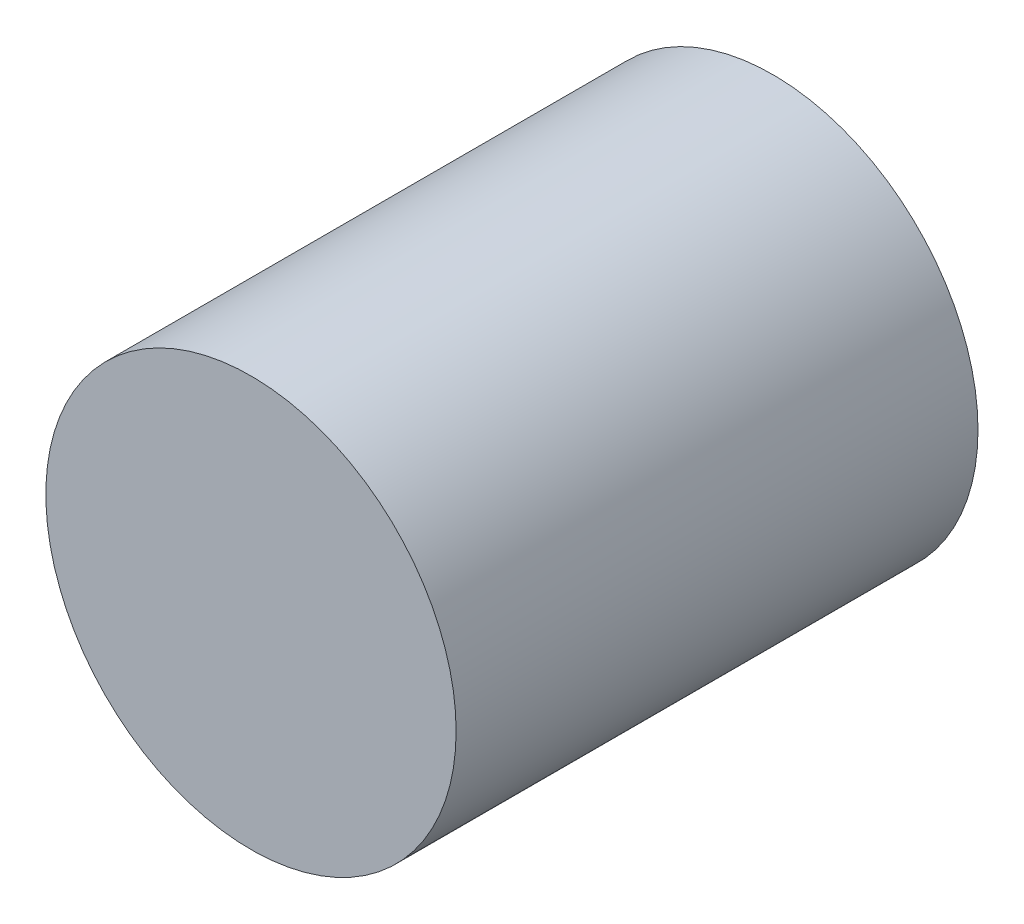
ISO-10303-21;
HEADER;
FILE_DESCRIPTION(('STEP AP214'),'2;1');
FILE_NAME('part.step','',(''),(''),'','','');
FILE_SCHEMA(('AUTOMOTIVE_DESIGN { 1 0 10303 214 1 1 1 1 }'));
ENDSEC;
DATA;
#1=APPLICATION_CONTEXT('core data for automotive mechanical design processes');
#2=APPLICATION_PROTOCOL_DEFINITION('international standard','automotive_design',2000,#1);
#3=PRODUCT_CONTEXT('',#1,'mechanical');
#4=PRODUCT('Part','Part','',(#3));
#5=PRODUCT_RELATED_PRODUCT_CATEGORY('part','',(#4));
#6=PRODUCT_DEFINITION_FORMATION('','',#4);
#7=PRODUCT_DEFINITION_CONTEXT('part definition',#1,'design');
#8=PRODUCT_DEFINITION('design','',#6,#7);
#9=PRODUCT_DEFINITION_SHAPE('','',#8);
#10=(LENGTH_UNIT() NAMED_UNIT(*) SI_UNIT(.MILLI.,.METRE.));
#11=(NAMED_UNIT(*) PLANE_ANGLE_UNIT() SI_UNIT($,.RADIAN.));
#12=(NAMED_UNIT(*) SI_UNIT($,.STERADIAN.) SOLID_ANGLE_UNIT());
#13=UNCERTAINTY_MEASURE_WITH_UNIT(LENGTH_MEASURE(1.E-05),#10,'distance_accuracy_value','');
#14=(GEOMETRIC_REPRESENTATION_CONTEXT(3) GLOBAL_UNCERTAINTY_ASSIGNED_CONTEXT((#13)) GLOBAL_UNIT_ASSIGNED_CONTEXT((#10,
#11,#12)) REPRESENTATION_CONTEXT('',''));
#15=CARTESIAN_POINT('',(0.,0.,0.));
#16=DIRECTION('',(0.,0.,1.));
#17=DIRECTION('',(1.,0.,0.));
#18=AXIS2_PLACEMENT_3D('',#15,#16,#17);
#19=CARTESIAN_POINT('',(0.,0.,30.4));
#20=DIRECTION('',(0.,0.,-1.));
#21=DIRECTION('',(-1.,0.,0.));
#22=AXIS2_PLACEMENT_3D('',#19,#20,#21);
#23=CYLINDRICAL_SURFACE('',#22,11.95);
#24=CARTESIAN_POINT('',(0.,0.,30.4));
#25=DIRECTION('',(0.,0.,1.));
#26=DIRECTION('',(1.,0.,0.));
#27=AXIS2_PLACEMENT_3D('',#24,#25,#26);
#28=CIRCLE('',#27,11.95);
#29=CARTESIAN_POINT('',(11.95,0.,30.4));
#30=VERTEX_POINT('',#29);
#31=EDGE_CURVE('E47',#30,#30,#28,.T.);
#32=ORIENTED_EDGE('',*,*,#31,.F.);
#33=EDGE_LOOP('',(#32));
#34=FACE_BOUND('',#33,.T.);
#35=CARTESIAN_POINT('',(0.,0.,0.));
#36=DIRECTION('',(0.,0.,1.));
#37=DIRECTION('',(1.,0.,0.));
#38=AXIS2_PLACEMENT_3D('',#35,#36,#37);
#39=CIRCLE('',#38,11.95);
#40=CARTESIAN_POINT('',(11.95,0.,0.));
#41=VERTEX_POINT('',#40);
#42=EDGE_CURVE('E51',#41,#41,#39,.T.);
#43=ORIENTED_EDGE('',*,*,#42,.T.);
#44=EDGE_LOOP('',(#43));
#45=FACE_BOUND('',#44,.T.);
#46=ADVANCED_FACE('F41',(#34,#45),#23,.T.);
#47=CARTESIAN_POINT('',(0.,0.,30.4));
#48=DIRECTION('',(0.,0.,1.));
#49=DIRECTION('',(1.,0.,0.));
#50=AXIS2_PLACEMENT_3D('',#47,#48,#49);
#51=PLANE('',#50);
#52=ORIENTED_EDGE('',*,*,#31,.T.);
#53=EDGE_LOOP('',(#52));
#54=FACE_BOUND('',#53,.T.);
#55=ADVANCED_FACE('F89',(#54),#51,.T.);
#56=CARTESIAN_POINT('',(0.,0.,0.));
#57=DIRECTION('',(0.,0.,1.));
#58=DIRECTION('',(1.,0.,0.));
#59=AXIS2_PLACEMENT_3D('',#56,#57,#58);
#60=PLANE('',#59);
#61=CARTESIAN_POINT('',(0.,0.,0.));
#62=DIRECTION('',(0.,0.,1.));
#63=DIRECTION('',(1.,0.,0.));
#64=AXIS2_PLACEMENT_3D('',#61,#62,#63);
#65=CIRCLE('',#64,0.99);
#66=CARTESIAN_POINT('',(0.99,0.,0.));
#67=VERTEX_POINT('',#66);
#68=EDGE_CURVE('E10',#67,#67,#65,.F.);
#69=ORIENTED_EDGE('',*,*,#68,.F.);
#70=EDGE_LOOP('',(#69));
#71=FACE_BOUND('',#70,.T.);
#72=CARTESIAN_POINT('',(0.,8.95,0.));
#73=DIRECTION('',(0.,0.,-1.));
#74=DIRECTION('',(-1.,0.,0.));
#75=AXIS2_PLACEMENT_3D('',#72,#73,#74);
#76=CIRCLE('',#75,1.5);
#77=CARTESIAN_POINT('',(-1.5,8.95,0.));
#78=VERTEX_POINT('',#77);
#79=EDGE_CURVE('E65',#78,#78,#76,.T.);
#80=ORIENTED_EDGE('',*,*,#79,.F.);
#81=EDGE_LOOP('',(#80));
#82=FACE_BOUND('',#81,.T.);
#83=CARTESIAN_POINT('',(0.,-8.95,0.));
#84=DIRECTION('',(0.,0.,-1.));
#85=DIRECTION('',(-1.,0.,0.));
#86=AXIS2_PLACEMENT_3D('',#83,#84,#85);
#87=CIRCLE('',#86,1.5);
#88=CARTESIAN_POINT('',(-1.5,-8.95,0.));
#89=VERTEX_POINT('',#88);
#90=EDGE_CURVE('E61',#89,#89,#87,.T.);
#91=ORIENTED_EDGE('',*,*,#90,.F.);
#92=EDGE_LOOP('',(#91));
#93=FACE_BOUND('',#92,.T.);
#94=ORIENTED_EDGE('',*,*,#42,.F.);
#95=EDGE_LOOP('',(#94));
#96=FACE_BOUND('',#95,.T.);
#97=ADVANCED_FACE('F94',(#71,#82,#93,#96),#60,.F.);
#98=CARTESIAN_POINT('',(0.,-8.95,3.));
#99=DIRECTION('',(0.,0.,-1.));
#100=DIRECTION('',(-1.,0.,0.));
#101=AXIS2_PLACEMENT_3D('',#98,#99,#100);
#102=CYLINDRICAL_SURFACE('',#101,1.5);
#103=CARTESIAN_POINT('',(0.,-8.95,3.));
#104=DIRECTION('',(0.,0.,-1.));
#105=DIRECTION('',(-1.,0.,0.));
#106=AXIS2_PLACEMENT_3D('',#103,#104,#105);
#107=CIRCLE('',#106,1.5);
#108=CARTESIAN_POINT('',(-1.5,-8.95,3.));
#109=VERTEX_POINT('',#108);
#110=EDGE_CURVE('E58',#109,#109,#107,.T.);
#111=ORIENTED_EDGE('',*,*,#110,.F.);
#112=EDGE_LOOP('',(#111));
#113=FACE_BOUND('',#112,.T.);
#114=ORIENTED_EDGE('',*,*,#90,.T.);
#115=EDGE_LOOP('',(#114));
#116=FACE_BOUND('',#115,.T.);
#117=ADVANCED_FACE('F99',(#113,#116),#102,.F.);
#118=CARTESIAN_POINT('',(0.,-8.95,3.));
#119=DIRECTION('',(0.,0.,-1.));
#120=DIRECTION('',(-1.,0.,0.));
#121=AXIS2_PLACEMENT_3D('',#118,#119,#120);
#122=PLANE('',#121);
#123=ORIENTED_EDGE('',*,*,#110,.T.);
#124=EDGE_LOOP('',(#123));
#125=FACE_BOUND('',#124,.T.);
#126=ADVANCED_FACE('F104',(#125),#122,.T.);
#127=CARTESIAN_POINT('',(0.,8.95,3.));
#128=DIRECTION('',(0.,0.,-1.));
#129=DIRECTION('',(-1.,0.,0.));
#130=AXIS2_PLACEMENT_3D('',#127,#128,#129);
#131=CYLINDRICAL_SURFACE('',#130,1.5);
#132=CARTESIAN_POINT('',(0.,8.95,3.));
#133=DIRECTION('',(0.,0.,-1.));
#134=DIRECTION('',(-1.,0.,0.));
#135=AXIS2_PLACEMENT_3D('',#132,#133,#134);
#136=CIRCLE('',#135,1.5);
#137=CARTESIAN_POINT('',(-1.5,8.95,3.));
#138=VERTEX_POINT('',#137);
#139=EDGE_CURVE('E56',#138,#138,#136,.T.);
#140=ORIENTED_EDGE('',*,*,#139,.F.);
#141=EDGE_LOOP('',(#140));
#142=FACE_BOUND('',#141,.T.);
#143=ORIENTED_EDGE('',*,*,#79,.T.);
#144=EDGE_LOOP('',(#143));
#145=FACE_BOUND('',#144,.T.);
#146=ADVANCED_FACE('F85',(#142,#145),#131,.F.);
#147=CARTESIAN_POINT('',(0.,8.95,3.));
#148=DIRECTION('',(0.,0.,-1.));
#149=DIRECTION('',(-1.,0.,0.));
#150=AXIS2_PLACEMENT_3D('',#147,#148,#149);
#151=PLANE('',#150);
#152=ORIENTED_EDGE('',*,*,#139,.T.);
#153=EDGE_LOOP('',(#152));
#154=FACE_BOUND('',#153,.T.);
#155=ADVANCED_FACE('F77',(#154),#151,.T.);
#156=CARTESIAN_POINT('',(0.,0.,-6.9));
#157=DIRECTION('',(0.,0.,1.));
#158=DIRECTION('',(1.,0.,0.));
#159=AXIS2_PLACEMENT_3D('',#156,#157,#158);
#160=CYLINDRICAL_SURFACE('',#159,0.99);
#161=CARTESIAN_POINT('',(0.,0.,-6.9));
#162=DIRECTION('',(0.,0.,-1.));
#163=DIRECTION('',(-1.,0.,0.));
#164=AXIS2_PLACEMENT_3D('',#161,#162,#163);
#165=CIRCLE('',#164,0.99);
#166=CARTESIAN_POINT('',(-0.99,0.,-6.9));
#167=VERTEX_POINT('',#166);
#168=EDGE_CURVE('E62',#167,#167,#165,.T.);
#169=ORIENTED_EDGE('',*,*,#168,.F.);
#170=EDGE_LOOP('',(#169));
#171=FACE_BOUND('',#170,.T.);
#172=ORIENTED_EDGE('',*,*,#68,.T.);
#173=EDGE_LOOP('',(#172));
#174=FACE_BOUND('',#173,.T.);
#175=ADVANCED_FACE('F75',(#171,#174),#160,.T.);
#176=CARTESIAN_POINT('',(0.,0.,-6.9));
#177=DIRECTION('',(0.,0.,-1.));
#178=DIRECTION('',(-1.,0.,0.));
#179=AXIS2_PLACEMENT_3D('',#176,#177,#178);
#180=PLANE('',#179);
#181=ORIENTED_EDGE('',*,*,#168,.T.);
#182=EDGE_LOOP('',(#181));
#183=FACE_BOUND('',#182,.T.);
#184=ADVANCED_FACE('F73',(#183),#180,.T.);
#185=CLOSED_SHELL('',(#46,#55,#97,#117,#126,#146,#155,#175,#184));
#186=MANIFOLD_SOLID_BREP('B2',#185);
#187=ADVANCED_BREP_SHAPE_REPRESENTATION('',(#18,#186),#14);
#188=SHAPE_DEFINITION_REPRESENTATION(#9,#187);
ENDSEC;
END-ISO-10303-21;
